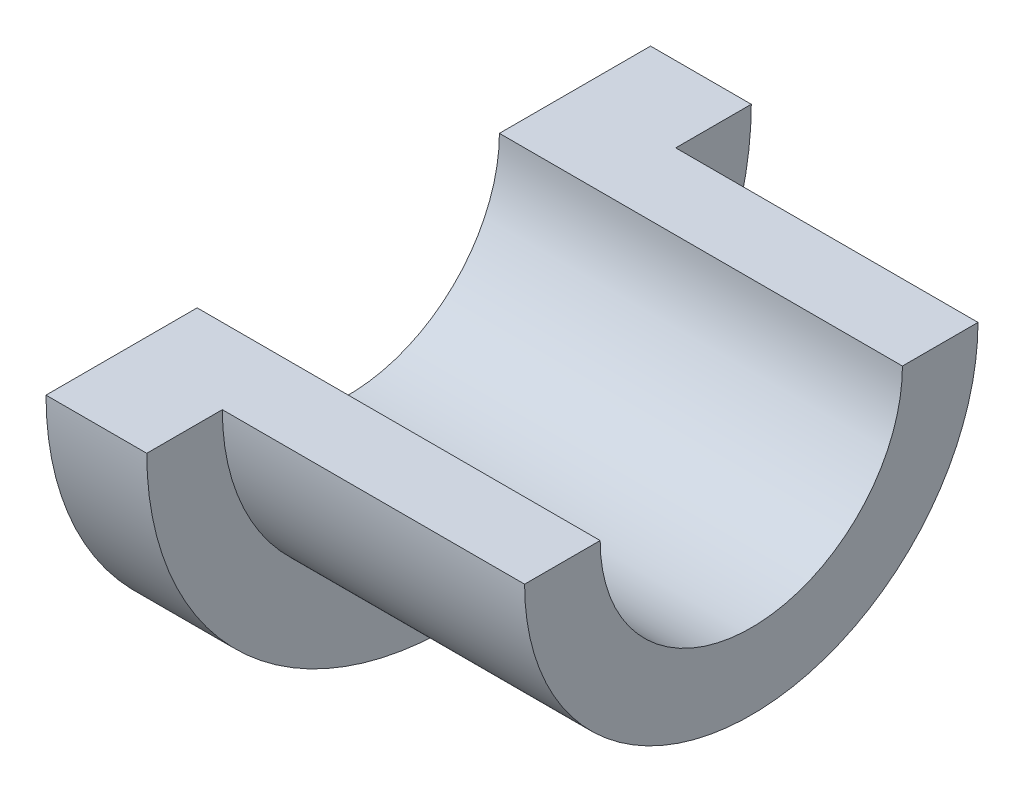
ISO-10303-21;
HEADER;
FILE_DESCRIPTION(('STEP AP214'),'2;1');
FILE_NAME('part.step','',(''),(''),'','','');
FILE_SCHEMA(('AUTOMOTIVE_DESIGN { 1 0 10303 214 1 1 1 1 }'));
ENDSEC;
DATA;
#1=APPLICATION_CONTEXT('core data for automotive mechanical design processes');
#2=APPLICATION_PROTOCOL_DEFINITION('international standard','automotive_design',2000,#1);
#3=PRODUCT_CONTEXT('',#1,'mechanical');
#4=PRODUCT('Part','Part','',(#3));
#5=PRODUCT_RELATED_PRODUCT_CATEGORY('part','',(#4));
#6=PRODUCT_DEFINITION_FORMATION('','',#4);
#7=PRODUCT_DEFINITION_CONTEXT('part definition',#1,'design');
#8=PRODUCT_DEFINITION('design','',#6,#7);
#9=PRODUCT_DEFINITION_SHAPE('','',#8);
#10=(LENGTH_UNIT() NAMED_UNIT(*) SI_UNIT(.MILLI.,.METRE.));
#11=(NAMED_UNIT(*) PLANE_ANGLE_UNIT() SI_UNIT($,.RADIAN.));
#12=(NAMED_UNIT(*) SI_UNIT($,.STERADIAN.) SOLID_ANGLE_UNIT());
#13=UNCERTAINTY_MEASURE_WITH_UNIT(LENGTH_MEASURE(1.E-05),#10,'distance_accuracy_value','');
#14=(GEOMETRIC_REPRESENTATION_CONTEXT(3) GLOBAL_UNCERTAINTY_ASSIGNED_CONTEXT((#13)) GLOBAL_UNIT_ASSIGNED_CONTEXT((#10,
#11,#12)) REPRESENTATION_CONTEXT('',''));
#15=CARTESIAN_POINT('',(0.,0.,0.));
#16=DIRECTION('',(0.,0.,1.));
#17=DIRECTION('',(1.,0.,0.));
#18=AXIS2_PLACEMENT_3D('',#15,#16,#17);
#19=CARTESIAN_POINT('',(2.,4.31566204368527,10.3669707788526));
#20=DIRECTION('',(-1.,0.,0.));
#21=DIRECTION('',(0.,0.,1.));
#22=AXIS2_PLACEMENT_3D('',#19,#20,#21);
#23=CYLINDRICAL_SURFACE('',#22,6.);
#24=CARTESIAN_POINT('',(2.,4.31566204368527,10.3669707788526));
#25=DIRECTION('',(1.,0.,0.));
#26=DIRECTION('',(0.,0.,-1.));
#27=AXIS2_PLACEMENT_3D('',#24,#25,#26);
#28=CIRCLE('',#27,6.);
#29=CARTESIAN_POINT('',(2.,4.31566204368527,16.3669707788527));
#30=VERTEX_POINT('',#29);
#31=CARTESIAN_POINT('',(2.,4.31566204368527,4.36697077885265));
#32=VERTEX_POINT('',#31);
#33=EDGE_CURVE('E109',#30,#32,#28,.T.);
#34=ORIENTED_EDGE('',*,*,#33,.F.);
#35=DIRECTION('',(-1.,0.,0.));
#36=VECTOR('',#35,1.);
#37=CARTESIAN_POINT('',(2.,4.31566204368527,16.3669707788527));
#38=LINE('',#37,#36);
#39=CARTESIAN_POINT('',(0.,4.31566204368527,16.3669707788527));
#40=VERTEX_POINT('',#39);
#41=EDGE_CURVE('E126',#30,#40,#38,.T.);
#42=ORIENTED_EDGE('',*,*,#41,.T.);
#43=CARTESIAN_POINT('',(0.,4.31566204368527,10.3669707788526));
#44=DIRECTION('',(1.,0.,0.));
#45=DIRECTION('',(0.,0.,-1.));
#46=AXIS2_PLACEMENT_3D('',#43,#44,#45);
#47=CIRCLE('',#46,6.);
#48=CARTESIAN_POINT('',(0.,4.31566204368527,4.36697077885265));
#49=VERTEX_POINT('',#48);
#50=EDGE_CURVE('E105',#40,#49,#47,.T.);
#51=ORIENTED_EDGE('',*,*,#50,.T.);
#52=DIRECTION('',(-1.,0.,0.));
#53=VECTOR('',#52,1.);
#54=CARTESIAN_POINT('',(2.,4.31566204368527,4.36697077885265));
#55=LINE('',#54,#53);
#56=EDGE_CURVE('E129',#49,#32,#55,.F.);
#57=ORIENTED_EDGE('',*,*,#56,.T.);
#58=EDGE_LOOP('',(#34,#42,#51,#57));
#59=FACE_BOUND('',#58,.T.);
#60=ADVANCED_FACE('F33',(#59),#23,.T.);
#61=CARTESIAN_POINT('',(2.,4.31566204368527,10.3669707788526));
#62=DIRECTION('',(1.,0.,0.));
#63=DIRECTION('',(0.,0.,-1.));
#64=AXIS2_PLACEMENT_3D('',#61,#62,#63);
#65=PLANE('',#64);
#66=DIRECTION('',(0.,0.,-1.));
#67=VECTOR('',#66,1.);
#68=CARTESIAN_POINT('',(2.,4.31566204368527,10.3669707788526));
#69=LINE('',#68,#67);
#70=CARTESIAN_POINT('',(2.,4.31566204368527,14.8669707788526));
#71=VERTEX_POINT('',#70);
#72=EDGE_CURVE('E85',#30,#71,#69,.T.);
#73=ORIENTED_EDGE('',*,*,#72,.F.);
#74=ORIENTED_EDGE('',*,*,#33,.T.);
#75=CARTESIAN_POINT('',(2.,4.31566204368527,5.86697077885265));
#76=VERTEX_POINT('',#75);
#77=EDGE_CURVE('E131',#76,#32,#69,.T.);
#78=ORIENTED_EDGE('',*,*,#77,.F.);
#79=CARTESIAN_POINT('',(2.,4.31566204368527,10.3669707788526));
#80=DIRECTION('',(1.,0.,0.));
#81=DIRECTION('',(0.,0.,-1.));
#82=AXIS2_PLACEMENT_3D('',#79,#80,#81);
#83=CIRCLE('',#82,4.5);
#84=EDGE_CURVE('E115',#71,#76,#83,.T.);
#85=ORIENTED_EDGE('',*,*,#84,.F.);
#86=EDGE_LOOP('',(#73,#74,#78,#85));
#87=FACE_BOUND('',#86,.T.);
#88=ADVANCED_FACE('F140',(#87),#65,.T.);
#89=CARTESIAN_POINT('',(0.,4.31566204368527,10.3669707788526));
#90=DIRECTION('',(1.,0.,0.));
#91=DIRECTION('',(0.,0.,-1.));
#92=AXIS2_PLACEMENT_3D('',#89,#90,#91);
#93=PLANE('',#92);
#94=ORIENTED_EDGE('',*,*,#50,.F.);
#95=DIRECTION('',(0.,0.,-1.));
#96=VECTOR('',#95,1.);
#97=CARTESIAN_POINT('',(0.,4.31566204368527,10.3669707788526));
#98=LINE('',#97,#96);
#99=CARTESIAN_POINT('',(0.,4.31566204368527,13.3669707788526));
#100=VERTEX_POINT('',#99);
#101=EDGE_CURVE('E99',#40,#100,#98,.T.);
#102=ORIENTED_EDGE('',*,*,#101,.T.);
#103=CARTESIAN_POINT('',(0.,4.31566204368527,10.3669707788526));
#104=DIRECTION('',(1.,0.,0.));
#105=DIRECTION('',(0.,0.,-1.));
#106=AXIS2_PLACEMENT_3D('',#103,#104,#105);
#107=CIRCLE('',#106,3.);
#108=CARTESIAN_POINT('',(0.,4.31566204368527,7.36697077885265));
#109=VERTEX_POINT('',#108);
#110=EDGE_CURVE('E106',#100,#109,#107,.T.);
#111=ORIENTED_EDGE('',*,*,#110,.T.);
#112=EDGE_CURVE('E47',#109,#49,#98,.T.);
#113=ORIENTED_EDGE('',*,*,#112,.T.);
#114=EDGE_LOOP('',(#94,#102,#111,#113));
#115=FACE_BOUND('',#114,.T.);
#116=ADVANCED_FACE('F125',(#115),#93,.F.);
#117=CARTESIAN_POINT('',(8.,4.31566204368527,10.3669707788526));
#118=DIRECTION('',(-1.,0.,0.));
#119=DIRECTION('',(0.,0.,1.));
#120=AXIS2_PLACEMENT_3D('',#117,#118,#119);
#121=CYLINDRICAL_SURFACE('',#120,4.5);
#122=CARTESIAN_POINT('',(8.,4.31566204368527,10.3669707788526));
#123=DIRECTION('',(1.,0.,0.));
#124=DIRECTION('',(0.,0.,-1.));
#125=AXIS2_PLACEMENT_3D('',#122,#123,#124);
#126=CIRCLE('',#125,4.5);
#127=CARTESIAN_POINT('',(8.,4.31566204368527,14.8669707788526));
#128=VERTEX_POINT('',#127);
#129=CARTESIAN_POINT('',(8.,4.31566204368527,5.86697077885265));
#130=VERTEX_POINT('',#129);
#131=EDGE_CURVE('E96',#128,#130,#126,.T.);
#132=ORIENTED_EDGE('',*,*,#131,.F.);
#133=DIRECTION('',(-1.,0.,0.));
#134=VECTOR('',#133,1.);
#135=CARTESIAN_POINT('',(8.,4.31566204368527,14.8669707788526));
#136=LINE('',#135,#134);
#137=EDGE_CURVE('E82',#128,#71,#136,.T.);
#138=ORIENTED_EDGE('',*,*,#137,.T.);
#139=ORIENTED_EDGE('',*,*,#84,.T.);
#140=DIRECTION('',(-1.,0.,0.));
#141=VECTOR('',#140,1.);
#142=CARTESIAN_POINT('',(8.,4.31566204368527,5.86697077885265));
#143=LINE('',#142,#141);
#144=EDGE_CURVE('E104',#76,#130,#143,.F.);
#145=ORIENTED_EDGE('',*,*,#144,.T.);
#146=EDGE_LOOP('',(#132,#138,#139,#145));
#147=FACE_BOUND('',#146,.T.);
#148=ADVANCED_FACE('F103',(#147),#121,.T.);
#149=CARTESIAN_POINT('',(8.,4.31566204368527,10.3669707788526));
#150=DIRECTION('',(1.,0.,0.));
#151=DIRECTION('',(0.,0.,-1.));
#152=AXIS2_PLACEMENT_3D('',#149,#150,#151);
#153=PLANE('',#152);
#154=DIRECTION('',(0.,0.,-1.));
#155=VECTOR('',#154,1.);
#156=CARTESIAN_POINT('',(8.,4.31566204368527,18.6736634683548));
#157=LINE('',#156,#155);
#158=CARTESIAN_POINT('',(8.,4.31566204368527,13.3669707788526));
#159=VERTEX_POINT('',#158);
#160=EDGE_CURVE('E54',#128,#159,#157,.T.);
#161=ORIENTED_EDGE('',*,*,#160,.F.);
#162=ORIENTED_EDGE('',*,*,#131,.T.);
#163=CARTESIAN_POINT('',(8.,4.31566204368527,7.36697077885265));
#164=VERTEX_POINT('',#163);
#165=EDGE_CURVE('E100',#164,#130,#157,.T.);
#166=ORIENTED_EDGE('',*,*,#165,.F.);
#167=CARTESIAN_POINT('',(8.,4.31566204368527,10.3669707788526));
#168=DIRECTION('',(1.,0.,0.));
#169=DIRECTION('',(0.,0.,-1.));
#170=AXIS2_PLACEMENT_3D('',#167,#168,#169);
#171=CIRCLE('',#170,3.);
#172=EDGE_CURVE('E98',#159,#164,#171,.T.);
#173=ORIENTED_EDGE('',*,*,#172,.F.);
#174=EDGE_LOOP('',(#161,#162,#166,#173));
#175=FACE_BOUND('',#174,.T.);
#176=ADVANCED_FACE('F94',(#175),#153,.T.);
#177=CARTESIAN_POINT('',(-3.,4.31566204368527,10.3669707788526));
#178=DIRECTION('',(1.,0.,0.));
#179=DIRECTION('',(0.,0.,-1.));
#180=AXIS2_PLACEMENT_3D('',#177,#178,#179);
#181=CYLINDRICAL_SURFACE('',#180,3.);
#182=ORIENTED_EDGE('',*,*,#172,.T.);
#183=DIRECTION('',(1.,0.,0.));
#184=VECTOR('',#183,1.);
#185=CARTESIAN_POINT('',(-3.,4.31566204368527,7.36697077885265));
#186=LINE('',#185,#184);
#187=EDGE_CURVE('E11',#164,#109,#186,.F.);
#188=ORIENTED_EDGE('',*,*,#187,.T.);
#189=ORIENTED_EDGE('',*,*,#110,.F.);
#190=DIRECTION('',(1.,0.,0.));
#191=VECTOR('',#190,1.);
#192=CARTESIAN_POINT('',(-3.,4.31566204368527,13.3669707788526));
#193=LINE('',#192,#191);
#194=EDGE_CURVE('E40',#100,#159,#193,.T.);
#195=ORIENTED_EDGE('',*,*,#194,.T.);
#196=EDGE_LOOP('',(#182,#188,#189,#195));
#197=FACE_BOUND('',#196,.T.);
#198=ADVANCED_FACE('F120',(#197),#181,.F.);
#199=CARTESIAN_POINT('',(-3.,4.31566204368527,18.6736634683548));
#200=DIRECTION('',(0.,-1.,0.));
#201=DIRECTION('',(0.,0.,-1.));
#202=AXIS2_PLACEMENT_3D('',#199,#200,#201);
#203=PLANE('',#202);
#204=ORIENTED_EDGE('',*,*,#160,.T.);
#205=ORIENTED_EDGE('',*,*,#194,.F.);
#206=ORIENTED_EDGE('',*,*,#101,.F.);
#207=ORIENTED_EDGE('',*,*,#41,.F.);
#208=ORIENTED_EDGE('',*,*,#72,.T.);
#209=ORIENTED_EDGE('',*,*,#137,.F.);
#210=EDGE_LOOP('',(#204,#205,#206,#207,#208,#209));
#211=FACE_BOUND('',#210,.T.);
#212=ADVANCED_FACE('F83',(#211),#203,.F.);
#213=ORIENTED_EDGE('',*,*,#77,.T.);
#214=ORIENTED_EDGE('',*,*,#56,.F.);
#215=ORIENTED_EDGE('',*,*,#112,.F.);
#216=ORIENTED_EDGE('',*,*,#187,.F.);
#217=ORIENTED_EDGE('',*,*,#165,.T.);
#218=ORIENTED_EDGE('',*,*,#144,.F.);
#219=EDGE_LOOP('',(#213,#214,#215,#216,#217,#218));
#220=FACE_BOUND('',#219,.T.);
#221=ADVANCED_FACE('F138',(#220),#203,.F.);
#222=CLOSED_SHELL('',(#60,#88,#116,#148,#176,#198,#212,#221));
#223=MANIFOLD_SOLID_BREP('B2',#222);
#224=ADVANCED_BREP_SHAPE_REPRESENTATION('',(#18,#223),#14);
#225=SHAPE_DEFINITION_REPRESENTATION(#9,#224);
ENDSEC;
END-ISO-10303-21;
